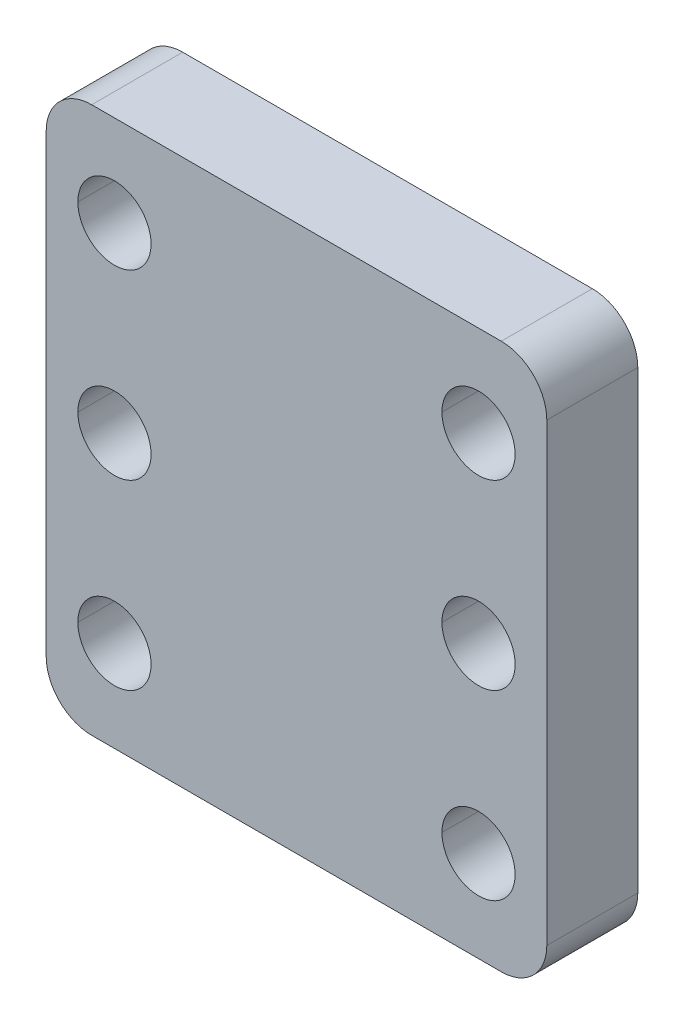
ISO-10303-21;
HEADER;
FILE_DESCRIPTION(('STEP AP214'),'2;1');
FILE_NAME('part.step','',(''),(''),'','','');
FILE_SCHEMA(('AUTOMOTIVE_DESIGN { 1 0 10303 214 1 1 1 1 }'));
ENDSEC;
DATA;
#1=APPLICATION_CONTEXT('core data for automotive mechanical design processes');
#2=APPLICATION_PROTOCOL_DEFINITION('international standard','automotive_design',2000,#1);
#3=PRODUCT_CONTEXT('',#1,'mechanical');
#4=PRODUCT('Part','Part','',(#3));
#5=PRODUCT_RELATED_PRODUCT_CATEGORY('part','',(#4));
#6=PRODUCT_DEFINITION_FORMATION('','',#4);
#7=PRODUCT_DEFINITION_CONTEXT('part definition',#1,'design');
#8=PRODUCT_DEFINITION('design','',#6,#7);
#9=PRODUCT_DEFINITION_SHAPE('','',#8);
#10=(LENGTH_UNIT() NAMED_UNIT(*) SI_UNIT(.MILLI.,.METRE.));
#11=(NAMED_UNIT(*) PLANE_ANGLE_UNIT() SI_UNIT($,.RADIAN.));
#12=(NAMED_UNIT(*) SI_UNIT($,.STERADIAN.) SOLID_ANGLE_UNIT());
#13=UNCERTAINTY_MEASURE_WITH_UNIT(LENGTH_MEASURE(1.E-05),#10,'distance_accuracy_value','');
#14=(GEOMETRIC_REPRESENTATION_CONTEXT(3) GLOBAL_UNCERTAINTY_ASSIGNED_CONTEXT((#13)) GLOBAL_UNIT_ASSIGNED_CONTEXT((#10,
#11,#12)) REPRESENTATION_CONTEXT('',''));
#15=CARTESIAN_POINT('',(0.,0.,0.));
#16=DIRECTION('',(0.,0.,1.));
#17=DIRECTION('',(1.,0.,0.));
#18=AXIS2_PLACEMENT_3D('',#15,#16,#17);
#19=CARTESIAN_POINT('',(-12.7,12.7,3.175));
#20=DIRECTION('',(0.,0.,1.));
#21=DIRECTION('',(1.,0.,0.));
#22=AXIS2_PLACEMENT_3D('',#19,#20,#21);
#23=CYLINDRICAL_SURFACE('',#22,2.5527);
#24=DIRECTION('',(0.,0.,1.));
#25=VECTOR('',#24,1.);
#26=CARTESIAN_POINT('',(-15.2527,12.7,3.175));
#27=LINE('',#26,#25);
#28=CARTESIAN_POINT('',(-15.2527,12.7,-3.175));
#29=VERTEX_POINT('',#28);
#30=CARTESIAN_POINT('',(-15.2527,12.7,3.175));
#31=VERTEX_POINT('',#30);
#32=EDGE_CURVE('E252',#29,#31,#27,.T.);
#33=ORIENTED_EDGE('',*,*,#32,.F.);
#34=CARTESIAN_POINT('',(-12.7,12.7,-3.175));
#35=DIRECTION('',(0.,0.,1.));
#36=DIRECTION('',(1.,0.,0.));
#37=AXIS2_PLACEMENT_3D('',#34,#35,#36);
#38=CIRCLE('',#37,2.5527);
#39=CARTESIAN_POINT('',(-10.1473,12.7,-3.175));
#40=VERTEX_POINT('',#39);
#41=EDGE_CURVE('E203',#40,#29,#38,.T.);
#42=ORIENTED_EDGE('',*,*,#41,.F.);
#43=DIRECTION('',(0.,0.,1.));
#44=VECTOR('',#43,1.);
#45=CARTESIAN_POINT('',(-10.1473,12.7,3.175));
#46=LINE('',#45,#44);
#47=CARTESIAN_POINT('',(-10.1473,12.7,3.175));
#48=VERTEX_POINT('',#47);
#49=EDGE_CURVE('E216',#40,#48,#46,.T.);
#50=ORIENTED_EDGE('',*,*,#49,.T.);
#51=CARTESIAN_POINT('',(-12.7,12.7,3.175));
#52=DIRECTION('',(0.,0.,1.));
#53=DIRECTION('',(1.,0.,0.));
#54=AXIS2_PLACEMENT_3D('',#51,#52,#53);
#55=CIRCLE('',#54,2.5527);
#56=EDGE_CURVE('E231',#48,#31,#55,.T.);
#57=ORIENTED_EDGE('',*,*,#56,.T.);
#58=EDGE_LOOP('',(#33,#42,#50,#57));
#59=FACE_BOUND('',#58,.T.);
#60=ADVANCED_FACE('F16',(#59),#23,.F.);
#61=CARTESIAN_POINT('',(-12.7,-12.7,3.175));
#62=DIRECTION('',(0.,0.,1.));
#63=DIRECTION('',(1.,0.,0.));
#64=AXIS2_PLACEMENT_3D('',#61,#62,#63);
#65=CYLINDRICAL_SURFACE('',#64,2.5527);
#66=DIRECTION('',(0.,0.,1.));
#67=VECTOR('',#66,1.);
#68=CARTESIAN_POINT('',(-15.2527,-12.7,3.175));
#69=LINE('',#68,#67);
#70=CARTESIAN_POINT('',(-15.2527,-12.7,-3.175));
#71=VERTEX_POINT('',#70);
#72=CARTESIAN_POINT('',(-15.2527,-12.7,3.175));
#73=VERTEX_POINT('',#72);
#74=EDGE_CURVE('E197',#71,#73,#69,.T.);
#75=ORIENTED_EDGE('',*,*,#74,.F.);
#76=CARTESIAN_POINT('',(-12.7,-12.7,-3.175));
#77=DIRECTION('',(0.,0.,1.));
#78=DIRECTION('',(1.,0.,0.));
#79=AXIS2_PLACEMENT_3D('',#76,#77,#78);
#80=CIRCLE('',#79,2.5527);
#81=CARTESIAN_POINT('',(-10.1473,-12.7,-3.175));
#82=VERTEX_POINT('',#81);
#83=EDGE_CURVE('E191',#82,#71,#80,.T.);
#84=ORIENTED_EDGE('',*,*,#83,.F.);
#85=DIRECTION('',(0.,0.,1.));
#86=VECTOR('',#85,1.);
#87=CARTESIAN_POINT('',(-10.1473,-12.7,3.175));
#88=LINE('',#87,#86);
#89=CARTESIAN_POINT('',(-10.1473,-12.7,3.175));
#90=VERTEX_POINT('',#89);
#91=EDGE_CURVE('E194',#82,#90,#88,.T.);
#92=ORIENTED_EDGE('',*,*,#91,.T.);
#93=CARTESIAN_POINT('',(-12.7,-12.7,3.175));
#94=DIRECTION('',(0.,0.,1.));
#95=DIRECTION('',(1.,0.,0.));
#96=AXIS2_PLACEMENT_3D('',#93,#94,#95);
#97=CIRCLE('',#96,2.5527);
#98=EDGE_CURVE('E304',#90,#73,#97,.T.);
#99=ORIENTED_EDGE('',*,*,#98,.T.);
#100=EDGE_LOOP('',(#75,#84,#92,#99));
#101=FACE_BOUND('',#100,.T.);
#102=ADVANCED_FACE('F193',(#101),#65,.F.);
#103=CARTESIAN_POINT('',(-12.7,0.,3.175));
#104=DIRECTION('',(0.,0.,1.));
#105=DIRECTION('',(1.,0.,0.));
#106=AXIS2_PLACEMENT_3D('',#103,#104,#105);
#107=CYLINDRICAL_SURFACE('',#106,2.5527);
#108=DIRECTION('',(0.,0.,1.));
#109=VECTOR('',#108,1.);
#110=CARTESIAN_POINT('',(-15.2527,0.,3.175));
#111=LINE('',#110,#109);
#112=CARTESIAN_POINT('',(-15.2527,0.,-3.175));
#113=VERTEX_POINT('',#112);
#114=CARTESIAN_POINT('',(-15.2527,0.,3.175));
#115=VERTEX_POINT('',#114);
#116=EDGE_CURVE('E263',#113,#115,#111,.T.);
#117=ORIENTED_EDGE('',*,*,#116,.F.);
#118=CARTESIAN_POINT('',(-12.7,0.,-3.175));
#119=DIRECTION('',(0.,0.,1.));
#120=DIRECTION('',(1.,0.,0.));
#121=AXIS2_PLACEMENT_3D('',#118,#119,#120);
#122=CIRCLE('',#121,2.5527);
#123=CARTESIAN_POINT('',(-10.1473,0.,-3.175));
#124=VERTEX_POINT('',#123);
#125=EDGE_CURVE('E202',#124,#113,#122,.T.);
#126=ORIENTED_EDGE('',*,*,#125,.F.);
#127=DIRECTION('',(0.,0.,1.));
#128=VECTOR('',#127,1.);
#129=CARTESIAN_POINT('',(-10.1473,0.,3.175));
#130=LINE('',#129,#128);
#131=CARTESIAN_POINT('',(-10.1473,0.,3.175));
#132=VERTEX_POINT('',#131);
#133=EDGE_CURVE('E262',#124,#132,#130,.T.);
#134=ORIENTED_EDGE('',*,*,#133,.T.);
#135=CARTESIAN_POINT('',(-12.7,0.,3.175));
#136=DIRECTION('',(0.,0.,1.));
#137=DIRECTION('',(1.,0.,0.));
#138=AXIS2_PLACEMENT_3D('',#135,#136,#137);
#139=CIRCLE('',#138,2.5527);
#140=EDGE_CURVE('E83',#132,#115,#139,.T.);
#141=ORIENTED_EDGE('',*,*,#140,.T.);
#142=EDGE_LOOP('',(#117,#126,#134,#141));
#143=FACE_BOUND('',#142,.T.);
#144=ADVANCED_FACE('F639',(#143),#107,.F.);
#145=CARTESIAN_POINT('',(12.7,0.,3.175));
#146=DIRECTION('',(0.,0.,1.));
#147=DIRECTION('',(1.,0.,0.));
#148=AXIS2_PLACEMENT_3D('',#145,#146,#147);
#149=CYLINDRICAL_SURFACE('',#148,2.5527);
#150=DIRECTION('',(0.,0.,1.));
#151=VECTOR('',#150,1.);
#152=CARTESIAN_POINT('',(10.1473,0.,3.175));
#153=LINE('',#152,#151);
#154=CARTESIAN_POINT('',(10.1473,0.,-3.175));
#155=VERTEX_POINT('',#154);
#156=CARTESIAN_POINT('',(10.1473,0.,3.175));
#157=VERTEX_POINT('',#156);
#158=EDGE_CURVE('E303',#155,#157,#153,.T.);
#159=ORIENTED_EDGE('',*,*,#158,.F.);
#160=CARTESIAN_POINT('',(12.7,0.,-3.175));
#161=DIRECTION('',(0.,0.,1.));
#162=DIRECTION('',(1.,0.,0.));
#163=AXIS2_PLACEMENT_3D('',#160,#161,#162);
#164=CIRCLE('',#163,2.5527);
#165=CARTESIAN_POINT('',(15.2527,0.,-3.175));
#166=VERTEX_POINT('',#165);
#167=EDGE_CURVE('E93',#166,#155,#164,.T.);
#168=ORIENTED_EDGE('',*,*,#167,.F.);
#169=DIRECTION('',(0.,0.,1.));
#170=VECTOR('',#169,1.);
#171=CARTESIAN_POINT('',(15.2527,0.,3.175));
#172=LINE('',#171,#170);
#173=CARTESIAN_POINT('',(15.2527,0.,3.175));
#174=VERTEX_POINT('',#173);
#175=EDGE_CURVE('E338',#166,#174,#172,.T.);
#176=ORIENTED_EDGE('',*,*,#175,.T.);
#177=CARTESIAN_POINT('',(12.7,0.,3.175));
#178=DIRECTION('',(0.,0.,1.));
#179=DIRECTION('',(1.,0.,0.));
#180=AXIS2_PLACEMENT_3D('',#177,#178,#179);
#181=CIRCLE('',#180,2.5527);
#182=EDGE_CURVE('E238',#174,#157,#181,.T.);
#183=ORIENTED_EDGE('',*,*,#182,.T.);
#184=EDGE_LOOP('',(#159,#168,#176,#183));
#185=FACE_BOUND('',#184,.T.);
#186=ADVANCED_FACE('F18',(#185),#149,.F.);
#187=CARTESIAN_POINT('',(12.7,12.7,3.175));
#188=DIRECTION('',(0.,0.,1.));
#189=DIRECTION('',(1.,0.,0.));
#190=AXIS2_PLACEMENT_3D('',#187,#188,#189);
#191=CYLINDRICAL_SURFACE('',#190,2.5527);
#192=DIRECTION('',(0.,0.,1.));
#193=VECTOR('',#192,1.);
#194=CARTESIAN_POINT('',(10.1473,12.7,3.175));
#195=LINE('',#194,#193);
#196=CARTESIAN_POINT('',(10.1473,12.7,-3.175));
#197=VERTEX_POINT('',#196);
#198=CARTESIAN_POINT('',(10.1473,12.7,3.175));
#199=VERTEX_POINT('',#198);
#200=EDGE_CURVE('E337',#197,#199,#195,.T.);
#201=ORIENTED_EDGE('',*,*,#200,.F.);
#202=CARTESIAN_POINT('',(12.7,12.7,-3.175));
#203=DIRECTION('',(0.,0.,1.));
#204=DIRECTION('',(1.,0.,0.));
#205=AXIS2_PLACEMENT_3D('',#202,#203,#204);
#206=CIRCLE('',#205,2.5527);
#207=CARTESIAN_POINT('',(15.2527,12.7,-3.175));
#208=VERTEX_POINT('',#207);
#209=EDGE_CURVE('E27',#208,#197,#206,.T.);
#210=ORIENTED_EDGE('',*,*,#209,.F.);
#211=DIRECTION('',(0.,0.,1.));
#212=VECTOR('',#211,1.);
#213=CARTESIAN_POINT('',(15.2527,12.7,3.175));
#214=LINE('',#213,#212);
#215=CARTESIAN_POINT('',(15.2527,12.7,3.175));
#216=VERTEX_POINT('',#215);
#217=EDGE_CURVE('E299',#208,#216,#214,.T.);
#218=ORIENTED_EDGE('',*,*,#217,.T.);
#219=CARTESIAN_POINT('',(12.7,12.7,3.175));
#220=DIRECTION('',(0.,0.,1.));
#221=DIRECTION('',(1.,0.,0.));
#222=AXIS2_PLACEMENT_3D('',#219,#220,#221);
#223=CIRCLE('',#222,2.5527);
#224=EDGE_CURVE('E241',#216,#199,#223,.T.);
#225=ORIENTED_EDGE('',*,*,#224,.T.);
#226=EDGE_LOOP('',(#201,#210,#218,#225));
#227=FACE_BOUND('',#226,.T.);
#228=ADVANCED_FACE('F683',(#227),#191,.F.);
#229=CARTESIAN_POINT('',(12.7,-12.7,3.175));
#230=DIRECTION('',(0.,0.,1.));
#231=DIRECTION('',(1.,0.,0.));
#232=AXIS2_PLACEMENT_3D('',#229,#230,#231);
#233=CYLINDRICAL_SURFACE('',#232,2.5527);
#234=DIRECTION('',(0.,0.,1.));
#235=VECTOR('',#234,1.);
#236=CARTESIAN_POINT('',(10.1473,-12.7,3.175));
#237=LINE('',#236,#235);
#238=CARTESIAN_POINT('',(10.1473,-12.7,-3.175));
#239=VERTEX_POINT('',#238);
#240=CARTESIAN_POINT('',(10.1473,-12.7,3.175));
#241=VERTEX_POINT('',#240);
#242=EDGE_CURVE('E298',#239,#241,#237,.T.);
#243=ORIENTED_EDGE('',*,*,#242,.F.);
#244=CARTESIAN_POINT('',(12.7,-12.7,-3.175));
#245=DIRECTION('',(0.,0.,1.));
#246=DIRECTION('',(1.,0.,0.));
#247=AXIS2_PLACEMENT_3D('',#244,#245,#246);
#248=CIRCLE('',#247,2.5527);
#249=CARTESIAN_POINT('',(15.2527,-12.7,-3.175));
#250=VERTEX_POINT('',#249);
#251=EDGE_CURVE('E11',#250,#239,#248,.T.);
#252=ORIENTED_EDGE('',*,*,#251,.F.);
#253=DIRECTION('',(0.,0.,1.));
#254=VECTOR('',#253,1.);
#255=CARTESIAN_POINT('',(15.2527,-12.7,3.175));
#256=LINE('',#255,#254);
#257=CARTESIAN_POINT('',(15.2527,-12.7,3.175));
#258=VERTEX_POINT('',#257);
#259=EDGE_CURVE('E307',#250,#258,#256,.T.);
#260=ORIENTED_EDGE('',*,*,#259,.T.);
#261=CARTESIAN_POINT('',(12.7,-12.7,3.175));
#262=DIRECTION('',(0.,0.,1.));
#263=DIRECTION('',(1.,0.,0.));
#264=AXIS2_PLACEMENT_3D('',#261,#262,#263);
#265=CIRCLE('',#264,2.5527);
#266=EDGE_CURVE('E20',#258,#241,#265,.T.);
#267=ORIENTED_EDGE('',*,*,#266,.T.);
#268=EDGE_LOOP('',(#243,#252,#260,#267));
#269=FACE_BOUND('',#268,.T.);
#270=ADVANCED_FACE('F606',(#269),#233,.F.);
#271=CARTESIAN_POINT('',(14.2875,15.875,3.175));
#272=DIRECTION('',(0.,0.,-1.));
#273=DIRECTION('',(-1.,0.,0.));
#274=AXIS2_PLACEMENT_3D('',#271,#272,#273);
#275=CYLINDRICAL_SURFACE('',#274,3.175);
#276=CARTESIAN_POINT('',(14.2875,15.875,3.175));
#277=DIRECTION('',(0.,0.,1.));
#278=DIRECTION('',(-1.,0.,0.));
#279=AXIS2_PLACEMENT_3D('',#276,#277,#278);
#280=CIRCLE('',#279,3.175);
#281=CARTESIAN_POINT('',(17.4625,15.875,3.175));
#282=VERTEX_POINT('',#281);
#283=CARTESIAN_POINT('',(14.2875,19.05,3.175));
#284=VERTEX_POINT('',#283);
#285=EDGE_CURVE('E279',#282,#284,#280,.T.);
#286=ORIENTED_EDGE('',*,*,#285,.F.);
#287=DIRECTION('',(0.,0.,1.));
#288=VECTOR('',#287,1.);
#289=CARTESIAN_POINT('',(17.4625,15.875,3.175));
#290=LINE('',#289,#288);
#291=CARTESIAN_POINT('',(17.4625,15.875,-3.175));
#292=VERTEX_POINT('',#291);
#293=EDGE_CURVE('E288',#292,#282,#290,.T.);
#294=ORIENTED_EDGE('',*,*,#293,.F.);
#295=CARTESIAN_POINT('',(14.2875,15.875,-3.175));
#296=DIRECTION('',(0.,0.,-1.));
#297=DIRECTION('',(-1.,0.,0.));
#298=AXIS2_PLACEMENT_3D('',#295,#296,#297);
#299=CIRCLE('',#298,3.175);
#300=CARTESIAN_POINT('',(14.2875,19.05,-3.175));
#301=VERTEX_POINT('',#300);
#302=EDGE_CURVE('E233',#301,#292,#299,.T.);
#303=ORIENTED_EDGE('',*,*,#302,.F.);
#304=DIRECTION('',(0.,0.,-1.));
#305=VECTOR('',#304,1.);
#306=CARTESIAN_POINT('',(14.2875,19.05,3.175));
#307=LINE('',#306,#305);
#308=EDGE_CURVE('E271',#284,#301,#307,.T.);
#309=ORIENTED_EDGE('',*,*,#308,.F.);
#310=EDGE_LOOP('',(#286,#294,#303,#309));
#311=FACE_BOUND('',#310,.T.);
#312=ADVANCED_FACE('F416',(#311),#275,.T.);
#313=CARTESIAN_POINT('',(-14.2875,15.875,3.175));
#314=DIRECTION('',(0.,0.,-1.));
#315=DIRECTION('',(-1.,0.,0.));
#316=AXIS2_PLACEMENT_3D('',#313,#314,#315);
#317=CYLINDRICAL_SURFACE('',#316,3.175);
#318=CARTESIAN_POINT('',(-14.2875,15.875,3.175));
#319=DIRECTION('',(0.,0.,1.));
#320=DIRECTION('',(-1.,0.,0.));
#321=AXIS2_PLACEMENT_3D('',#318,#319,#320);
#322=CIRCLE('',#321,3.175);
#323=CARTESIAN_POINT('',(-14.2875,19.05,3.175));
#324=VERTEX_POINT('',#323);
#325=CARTESIAN_POINT('',(-17.4625,15.875,3.175));
#326=VERTEX_POINT('',#325);
#327=EDGE_CURVE('E232',#324,#326,#322,.T.);
#328=ORIENTED_EDGE('',*,*,#327,.F.);
#329=DIRECTION('',(0.,0.,1.));
#330=VECTOR('',#329,1.);
#331=CARTESIAN_POINT('',(-14.2875,19.05,3.175));
#332=LINE('',#331,#330);
#333=CARTESIAN_POINT('',(-14.2875,19.05,-3.175));
#334=VERTEX_POINT('',#333);
#335=EDGE_CURVE('E272',#334,#324,#332,.T.);
#336=ORIENTED_EDGE('',*,*,#335,.F.);
#337=CARTESIAN_POINT('',(-14.2875,15.875,-3.175));
#338=DIRECTION('',(0.,0.,-1.));
#339=DIRECTION('',(-1.,0.,0.));
#340=AXIS2_PLACEMENT_3D('',#337,#338,#339);
#341=CIRCLE('',#340,3.175);
#342=CARTESIAN_POINT('',(-17.4625,15.875,-3.175));
#343=VERTEX_POINT('',#342);
#344=EDGE_CURVE('E237',#343,#334,#341,.T.);
#345=ORIENTED_EDGE('',*,*,#344,.F.);
#346=DIRECTION('',(0.,0.,-1.));
#347=VECTOR('',#346,1.);
#348=CARTESIAN_POINT('',(-17.4625,15.875,3.175));
#349=LINE('',#348,#347);
#350=EDGE_CURVE('E242',#326,#343,#349,.T.);
#351=ORIENTED_EDGE('',*,*,#350,.F.);
#352=EDGE_LOOP('',(#328,#336,#345,#351));
#353=FACE_BOUND('',#352,.T.);
#354=ADVANCED_FACE('F408',(#353),#317,.T.);
#355=CARTESIAN_POINT('',(-14.2875,-15.875,3.175));
#356=DIRECTION('',(0.,0.,-1.));
#357=DIRECTION('',(-1.,0.,0.));
#358=AXIS2_PLACEMENT_3D('',#355,#356,#357);
#359=CYLINDRICAL_SURFACE('',#358,3.175);
#360=CARTESIAN_POINT('',(-14.2875,-15.875,3.175));
#361=DIRECTION('',(0.,0.,1.));
#362=DIRECTION('',(-1.,0.,0.));
#363=AXIS2_PLACEMENT_3D('',#360,#361,#362);
#364=CIRCLE('',#363,3.175);
#365=CARTESIAN_POINT('',(-17.4625,-15.875,3.175));
#366=VERTEX_POINT('',#365);
#367=CARTESIAN_POINT('',(-14.2875,-19.05,3.175));
#368=VERTEX_POINT('',#367);
#369=EDGE_CURVE('E42',#366,#368,#364,.T.);
#370=ORIENTED_EDGE('',*,*,#369,.F.);
#371=DIRECTION('',(0.,0.,1.));
#372=VECTOR('',#371,1.);
#373=CARTESIAN_POINT('',(-17.4625,-15.875,3.175));
#374=LINE('',#373,#372);
#375=CARTESIAN_POINT('',(-17.4625,-15.875,-3.175));
#376=VERTEX_POINT('',#375);
#377=EDGE_CURVE('E287',#376,#366,#374,.T.);
#378=ORIENTED_EDGE('',*,*,#377,.F.);
#379=CARTESIAN_POINT('',(-14.2875,-15.875,-3.175));
#380=DIRECTION('',(0.,0.,-1.));
#381=DIRECTION('',(-1.,0.,0.));
#382=AXIS2_PLACEMENT_3D('',#379,#380,#381);
#383=CIRCLE('',#382,3.175);
#384=CARTESIAN_POINT('',(-14.2875,-19.05,-3.175));
#385=VERTEX_POINT('',#384);
#386=EDGE_CURVE('E318',#385,#376,#383,.T.);
#387=ORIENTED_EDGE('',*,*,#386,.F.);
#388=DIRECTION('',(0.,0.,-1.));
#389=VECTOR('',#388,1.);
#390=CARTESIAN_POINT('',(-14.2875,-19.05,3.175));
#391=LINE('',#390,#389);
#392=EDGE_CURVE('E256',#368,#385,#391,.T.);
#393=ORIENTED_EDGE('',*,*,#392,.F.);
#394=EDGE_LOOP('',(#370,#378,#387,#393));
#395=FACE_BOUND('',#394,.T.);
#396=ADVANCED_FACE('F588',(#395),#359,.T.);
#397=CARTESIAN_POINT('',(14.2875,-15.875,3.175));
#398=DIRECTION('',(0.,0.,-1.));
#399=DIRECTION('',(-1.,0.,0.));
#400=AXIS2_PLACEMENT_3D('',#397,#398,#399);
#401=CYLINDRICAL_SURFACE('',#400,3.175);
#402=CARTESIAN_POINT('',(14.2875,-15.875,3.175));
#403=DIRECTION('',(0.,0.,1.));
#404=DIRECTION('',(-1.,0.,0.));
#405=AXIS2_PLACEMENT_3D('',#402,#403,#404);
#406=CIRCLE('',#405,3.175);
#407=CARTESIAN_POINT('',(14.2875,-19.05,3.175));
#408=VERTEX_POINT('',#407);
#409=CARTESIAN_POINT('',(17.4625,-15.875,3.175));
#410=VERTEX_POINT('',#409);
#411=EDGE_CURVE('E276',#408,#410,#406,.T.);
#412=ORIENTED_EDGE('',*,*,#411,.F.);
#413=DIRECTION('',(0.,0.,1.));
#414=VECTOR('',#413,1.);
#415=CARTESIAN_POINT('',(14.2875,-19.05,3.175));
#416=LINE('',#415,#414);
#417=CARTESIAN_POINT('',(14.2875,-19.05,-3.175));
#418=VERTEX_POINT('',#417);
#419=EDGE_CURVE('E257',#418,#408,#416,.T.);
#420=ORIENTED_EDGE('',*,*,#419,.F.);
#421=CARTESIAN_POINT('',(14.2875,-15.875,-3.175));
#422=DIRECTION('',(0.,0.,-1.));
#423=DIRECTION('',(-1.,0.,0.));
#424=AXIS2_PLACEMENT_3D('',#421,#422,#423);
#425=CIRCLE('',#424,3.175);
#426=CARTESIAN_POINT('',(17.4625,-15.875,-3.175));
#427=VERTEX_POINT('',#426);
#428=EDGE_CURVE('E575',#427,#418,#425,.T.);
#429=ORIENTED_EDGE('',*,*,#428,.F.);
#430=DIRECTION('',(0.,0.,-1.));
#431=VECTOR('',#430,1.);
#432=CARTESIAN_POINT('',(17.4625,-15.875,3.175));
#433=LINE('',#432,#431);
#434=EDGE_CURVE('E345',#410,#427,#433,.T.);
#435=ORIENTED_EDGE('',*,*,#434,.F.);
#436=EDGE_LOOP('',(#412,#420,#429,#435));
#437=FACE_BOUND('',#436,.T.);
#438=ADVANCED_FACE('F582',(#437),#401,.T.);
#439=CARTESIAN_POINT('',(0.,0.,-3.175));
#440=DIRECTION('',(0.,0.,-1.));
#441=DIRECTION('',(0.,-1.,0.));
#442=AXIS2_PLACEMENT_3D('',#439,#440,#441);
#443=PLANE('',#442);
#444=ORIENTED_EDGE('',*,*,#251,.T.);
#445=CARTESIAN_POINT('',(12.7,-12.7,-3.175));
#446=DIRECTION('',(0.,0.,1.));
#447=DIRECTION('',(1.,0.,0.));
#448=AXIS2_PLACEMENT_3D('',#445,#446,#447);
#449=CIRCLE('',#448,2.5527);
#450=EDGE_CURVE('E294',#239,#250,#449,.T.);
#451=ORIENTED_EDGE('',*,*,#450,.T.);
#452=EDGE_LOOP('',(#444,#451));
#453=FACE_BOUND('',#452,.T.);
#454=ORIENTED_EDGE('',*,*,#209,.T.);
#455=CARTESIAN_POINT('',(12.7,12.7,-3.175));
#456=DIRECTION('',(0.,0.,1.));
#457=DIRECTION('',(1.,0.,0.));
#458=AXIS2_PLACEMENT_3D('',#455,#456,#457);
#459=CIRCLE('',#458,2.5527);
#460=EDGE_CURVE('E333',#197,#208,#459,.T.);
#461=ORIENTED_EDGE('',*,*,#460,.T.);
#462=EDGE_LOOP('',(#454,#461));
#463=FACE_BOUND('',#462,.T.);
#464=ORIENTED_EDGE('',*,*,#167,.T.);
#465=CARTESIAN_POINT('',(12.7,0.,-3.175));
#466=DIRECTION('',(0.,0.,1.));
#467=DIRECTION('',(1.,0.,0.));
#468=AXIS2_PLACEMENT_3D('',#465,#466,#467);
#469=CIRCLE('',#468,2.5527);
#470=EDGE_CURVE('E300',#155,#166,#469,.T.);
#471=ORIENTED_EDGE('',*,*,#470,.T.);
#472=EDGE_LOOP('',(#464,#471));
#473=FACE_BOUND('',#472,.T.);
#474=ORIENTED_EDGE('',*,*,#125,.T.);
#475=CARTESIAN_POINT('',(-12.7,0.,-3.175));
#476=DIRECTION('',(0.,0.,1.));
#477=DIRECTION('',(1.,0.,0.));
#478=AXIS2_PLACEMENT_3D('',#475,#476,#477);
#479=CIRCLE('',#478,2.5527);
#480=EDGE_CURVE('E211',#113,#124,#479,.T.);
#481=ORIENTED_EDGE('',*,*,#480,.T.);
#482=EDGE_LOOP('',(#474,#481));
#483=FACE_BOUND('',#482,.T.);
#484=ORIENTED_EDGE('',*,*,#83,.T.);
#485=CARTESIAN_POINT('',(-12.7,-12.7,-3.175));
#486=DIRECTION('',(0.,0.,1.));
#487=DIRECTION('',(1.,0.,0.));
#488=AXIS2_PLACEMENT_3D('',#485,#486,#487);
#489=CIRCLE('',#488,2.5527);
#490=EDGE_CURVE('E207',#71,#82,#489,.T.);
#491=ORIENTED_EDGE('',*,*,#490,.T.);
#492=EDGE_LOOP('',(#484,#491));
#493=FACE_BOUND('',#492,.T.);
#494=ORIENTED_EDGE('',*,*,#41,.T.);
#495=CARTESIAN_POINT('',(-12.7,12.7,-3.175));
#496=DIRECTION('',(0.,0.,1.));
#497=DIRECTION('',(1.,0.,0.));
#498=AXIS2_PLACEMENT_3D('',#495,#496,#497);
#499=CIRCLE('',#498,2.5527);
#500=EDGE_CURVE('E248',#29,#40,#499,.T.);
#501=ORIENTED_EDGE('',*,*,#500,.T.);
#502=EDGE_LOOP('',(#494,#501));
#503=FACE_BOUND('',#502,.T.);
#504=DIRECTION('',(0.,1.,0.));
#505=VECTOR('',#504,1.);
#506=CARTESIAN_POINT('',(17.4625,-19.05,-3.175));
#507=LINE('',#506,#505);
#508=EDGE_CURVE('E293',#427,#292,#507,.T.);
#509=ORIENTED_EDGE('',*,*,#508,.F.);
#510=ORIENTED_EDGE('',*,*,#428,.T.);
#511=DIRECTION('',(1.,0.,0.));
#512=VECTOR('',#511,1.);
#513=CARTESIAN_POINT('',(-17.4625,-19.05,-3.175));
#514=LINE('',#513,#512);
#515=EDGE_CURVE('E246',#385,#418,#514,.T.);
#516=ORIENTED_EDGE('',*,*,#515,.F.);
#517=ORIENTED_EDGE('',*,*,#386,.T.);
#518=DIRECTION('',(0.,-1.,0.));
#519=VECTOR('',#518,1.);
#520=CARTESIAN_POINT('',(-17.4625,-19.05,-3.175));
#521=LINE('',#520,#519);
#522=EDGE_CURVE('E326',#343,#376,#521,.T.);
#523=ORIENTED_EDGE('',*,*,#522,.F.);
#524=ORIENTED_EDGE('',*,*,#344,.T.);
#525=DIRECTION('',(-1.,0.,0.));
#526=VECTOR('',#525,1.);
#527=CARTESIAN_POINT('',(-17.4625,19.05,-3.175));
#528=LINE('',#527,#526);
#529=EDGE_CURVE('E292',#301,#334,#528,.T.);
#530=ORIENTED_EDGE('',*,*,#529,.F.);
#531=ORIENTED_EDGE('',*,*,#302,.T.);
#532=EDGE_LOOP('',(#509,#510,#516,#517,#523,#524,#530,#531));
#533=FACE_BOUND('',#532,.T.);
#534=ADVANCED_FACE('F213',(#453,#463,#473,#483,#493,#503,#533),#443,.T.);
#535=CARTESIAN_POINT('',(0.,0.,3.175));
#536=DIRECTION('',(0.,0.,-1.));
#537=DIRECTION('',(0.,-1.,0.));
#538=AXIS2_PLACEMENT_3D('',#535,#536,#537);
#539=PLANE('',#538);
#540=ORIENTED_EDGE('',*,*,#266,.F.);
#541=CARTESIAN_POINT('',(12.7,-12.7,3.175));
#542=DIRECTION('',(0.,0.,1.));
#543=DIRECTION('',(1.,0.,0.));
#544=AXIS2_PLACEMENT_3D('',#541,#542,#543);
#545=CIRCLE('',#544,2.5527);
#546=EDGE_CURVE('E312',#241,#258,#545,.T.);
#547=ORIENTED_EDGE('',*,*,#546,.F.);
#548=EDGE_LOOP('',(#540,#547));
#549=FACE_BOUND('',#548,.T.);
#550=ORIENTED_EDGE('',*,*,#224,.F.);
#551=CARTESIAN_POINT('',(12.7,12.7,3.175));
#552=DIRECTION('',(0.,0.,1.));
#553=DIRECTION('',(1.,0.,0.));
#554=AXIS2_PLACEMENT_3D('',#551,#552,#553);
#555=CIRCLE('',#554,2.5527);
#556=EDGE_CURVE('E316',#199,#216,#555,.T.);
#557=ORIENTED_EDGE('',*,*,#556,.F.);
#558=EDGE_LOOP('',(#550,#557));
#559=FACE_BOUND('',#558,.T.);
#560=ORIENTED_EDGE('',*,*,#182,.F.);
#561=CARTESIAN_POINT('',(12.7,0.,3.175));
#562=DIRECTION('',(0.,0.,1.));
#563=DIRECTION('',(1.,0.,0.));
#564=AXIS2_PLACEMENT_3D('',#561,#562,#563);
#565=CIRCLE('',#564,2.5527);
#566=EDGE_CURVE('E331',#157,#174,#565,.T.);
#567=ORIENTED_EDGE('',*,*,#566,.F.);
#568=EDGE_LOOP('',(#560,#567));
#569=FACE_BOUND('',#568,.T.);
#570=ORIENTED_EDGE('',*,*,#140,.F.);
#571=CARTESIAN_POINT('',(-12.7,0.,3.175));
#572=DIRECTION('',(0.,0.,1.));
#573=DIRECTION('',(1.,0.,0.));
#574=AXIS2_PLACEMENT_3D('',#571,#572,#573);
#575=CIRCLE('',#574,2.5527);
#576=EDGE_CURVE('E258',#115,#132,#575,.T.);
#577=ORIENTED_EDGE('',*,*,#576,.F.);
#578=EDGE_LOOP('',(#570,#577));
#579=FACE_BOUND('',#578,.T.);
#580=ORIENTED_EDGE('',*,*,#98,.F.);
#581=CARTESIAN_POINT('',(-12.7,-12.7,3.175));
#582=DIRECTION('',(0.,0.,1.));
#583=DIRECTION('',(1.,0.,0.));
#584=AXIS2_PLACEMENT_3D('',#581,#582,#583);
#585=CIRCLE('',#584,2.5527);
#586=EDGE_CURVE('E209',#73,#90,#585,.T.);
#587=ORIENTED_EDGE('',*,*,#586,.F.);
#588=EDGE_LOOP('',(#580,#587));
#589=FACE_BOUND('',#588,.T.);
#590=ORIENTED_EDGE('',*,*,#56,.F.);
#591=CARTESIAN_POINT('',(-12.7,12.7,3.175));
#592=DIRECTION('',(0.,0.,1.));
#593=DIRECTION('',(1.,0.,0.));
#594=AXIS2_PLACEMENT_3D('',#591,#592,#593);
#595=CIRCLE('',#594,2.5527);
#596=EDGE_CURVE('E225',#31,#48,#595,.T.);
#597=ORIENTED_EDGE('',*,*,#596,.F.);
#598=EDGE_LOOP('',(#590,#597));
#599=FACE_BOUND('',#598,.T.);
#600=DIRECTION('',(1.,0.,0.));
#601=VECTOR('',#600,1.);
#602=CARTESIAN_POINT('',(-17.4625,-19.05,3.175));
#603=LINE('',#602,#601);
#604=EDGE_CURVE('E253',#368,#408,#603,.T.);
#605=ORIENTED_EDGE('',*,*,#604,.T.);
#606=ORIENTED_EDGE('',*,*,#411,.T.);
#607=DIRECTION('',(0.,1.,0.));
#608=VECTOR('',#607,1.);
#609=CARTESIAN_POINT('',(17.4625,-19.05,3.175));
#610=LINE('',#609,#608);
#611=EDGE_CURVE('E311',#410,#282,#610,.T.);
#612=ORIENTED_EDGE('',*,*,#611,.T.);
#613=ORIENTED_EDGE('',*,*,#285,.T.);
#614=DIRECTION('',(-1.,0.,0.));
#615=VECTOR('',#614,1.);
#616=CARTESIAN_POINT('',(-17.4625,19.05,3.175));
#617=LINE('',#616,#615);
#618=EDGE_CURVE('E267',#284,#324,#617,.T.);
#619=ORIENTED_EDGE('',*,*,#618,.T.);
#620=ORIENTED_EDGE('',*,*,#327,.T.);
#621=DIRECTION('',(0.,-1.,0.));
#622=VECTOR('',#621,1.);
#623=CARTESIAN_POINT('',(-17.4625,-19.05,3.175));
#624=LINE('',#623,#622);
#625=EDGE_CURVE('E247',#326,#366,#624,.T.);
#626=ORIENTED_EDGE('',*,*,#625,.T.);
#627=ORIENTED_EDGE('',*,*,#369,.T.);
#628=EDGE_LOOP('',(#605,#606,#612,#613,#619,#620,#626,#627));
#629=FACE_BOUND('',#628,.T.);
#630=ADVANCED_FACE('F411',(#549,#559,#569,#579,#589,#599,#629),#539,.F.);
#631=CARTESIAN_POINT('',(-17.4625,-19.05,3.175));
#632=DIRECTION('',(0.,1.,0.));
#633=DIRECTION('',(1.,0.,0.));
#634=AXIS2_PLACEMENT_3D('',#631,#632,#633);
#635=PLANE('',#634);
#636=ORIENTED_EDGE('',*,*,#515,.T.);
#637=ORIENTED_EDGE('',*,*,#419,.T.);
#638=ORIENTED_EDGE('',*,*,#604,.F.);
#639=ORIENTED_EDGE('',*,*,#392,.T.);
#640=EDGE_LOOP('',(#636,#637,#638,#639));
#641=FACE_BOUND('',#640,.T.);
#642=ADVANCED_FACE('F586',(#641),#635,.F.);
#643=CARTESIAN_POINT('',(-17.4625,-19.05,3.175));
#644=DIRECTION('',(1.,0.,0.));
#645=DIRECTION('',(0.,1.,0.));
#646=AXIS2_PLACEMENT_3D('',#643,#644,#645);
#647=PLANE('',#646);
#648=ORIENTED_EDGE('',*,*,#522,.T.);
#649=ORIENTED_EDGE('',*,*,#377,.T.);
#650=ORIENTED_EDGE('',*,*,#625,.F.);
#651=ORIENTED_EDGE('',*,*,#350,.T.);
#652=EDGE_LOOP('',(#648,#649,#650,#651));
#653=FACE_BOUND('',#652,.T.);
#654=ADVANCED_FACE('F423',(#653),#647,.F.);
#655=CARTESIAN_POINT('',(-17.4625,19.05,3.175));
#656=DIRECTION('',(0.,-1.,0.));
#657=DIRECTION('',(0.,0.,-1.));
#658=AXIS2_PLACEMENT_3D('',#655,#656,#657);
#659=PLANE('',#658);
#660=ORIENTED_EDGE('',*,*,#529,.T.);
#661=ORIENTED_EDGE('',*,*,#335,.T.);
#662=ORIENTED_EDGE('',*,*,#618,.F.);
#663=ORIENTED_EDGE('',*,*,#308,.T.);
#664=EDGE_LOOP('',(#660,#661,#662,#663));
#665=FACE_BOUND('',#664,.T.);
#666=ADVANCED_FACE('F405',(#665),#659,.F.);
#667=CARTESIAN_POINT('',(17.4625,-19.05,3.175));
#668=DIRECTION('',(-1.,0.,0.));
#669=DIRECTION('',(0.,0.,1.));
#670=AXIS2_PLACEMENT_3D('',#667,#668,#669);
#671=PLANE('',#670);
#672=ORIENTED_EDGE('',*,*,#611,.F.);
#673=ORIENTED_EDGE('',*,*,#434,.T.);
#674=ORIENTED_EDGE('',*,*,#508,.T.);
#675=ORIENTED_EDGE('',*,*,#293,.T.);
#676=EDGE_LOOP('',(#672,#673,#674,#675));
#677=FACE_BOUND('',#676,.T.);
#678=ADVANCED_FACE('F651',(#677),#671,.F.);
#679=CARTESIAN_POINT('',(12.7,-12.7,3.175));
#680=DIRECTION('',(0.,0.,1.));
#681=DIRECTION('',(1.,0.,0.));
#682=AXIS2_PLACEMENT_3D('',#679,#680,#681);
#683=CYLINDRICAL_SURFACE('',#682,2.5527);
#684=ORIENTED_EDGE('',*,*,#450,.F.);
#685=ORIENTED_EDGE('',*,*,#242,.T.);
#686=ORIENTED_EDGE('',*,*,#546,.T.);
#687=ORIENTED_EDGE('',*,*,#259,.F.);
#688=EDGE_LOOP('',(#684,#685,#686,#687));
#689=FACE_BOUND('',#688,.T.);
#690=ADVANCED_FACE('F602',(#689),#683,.F.);
#691=CARTESIAN_POINT('',(12.7,12.7,3.175));
#692=DIRECTION('',(0.,0.,1.));
#693=DIRECTION('',(1.,0.,0.));
#694=AXIS2_PLACEMENT_3D('',#691,#692,#693);
#695=CYLINDRICAL_SURFACE('',#694,2.5527);
#696=ORIENTED_EDGE('',*,*,#460,.F.);
#697=ORIENTED_EDGE('',*,*,#200,.T.);
#698=ORIENTED_EDGE('',*,*,#556,.T.);
#699=ORIENTED_EDGE('',*,*,#217,.F.);
#700=EDGE_LOOP('',(#696,#697,#698,#699));
#701=FACE_BOUND('',#700,.T.);
#702=ADVANCED_FACE('F645',(#701),#695,.F.);
#703=CARTESIAN_POINT('',(12.7,0.,3.175));
#704=DIRECTION('',(0.,0.,1.));
#705=DIRECTION('',(1.,0.,0.));
#706=AXIS2_PLACEMENT_3D('',#703,#704,#705);
#707=CYLINDRICAL_SURFACE('',#706,2.5527);
#708=ORIENTED_EDGE('',*,*,#470,.F.);
#709=ORIENTED_EDGE('',*,*,#158,.T.);
#710=ORIENTED_EDGE('',*,*,#566,.T.);
#711=ORIENTED_EDGE('',*,*,#175,.F.);
#712=EDGE_LOOP('',(#708,#709,#710,#711));
#713=FACE_BOUND('',#712,.T.);
#714=ADVANCED_FACE('F648',(#713),#707,.F.);
#715=CARTESIAN_POINT('',(-12.7,0.,3.175));
#716=DIRECTION('',(0.,0.,1.));
#717=DIRECTION('',(1.,0.,0.));
#718=AXIS2_PLACEMENT_3D('',#715,#716,#717);
#719=CYLINDRICAL_SURFACE('',#718,2.5527);
#720=ORIENTED_EDGE('',*,*,#480,.F.);
#721=ORIENTED_EDGE('',*,*,#116,.T.);
#722=ORIENTED_EDGE('',*,*,#576,.T.);
#723=ORIENTED_EDGE('',*,*,#133,.F.);
#724=EDGE_LOOP('',(#720,#721,#722,#723));
#725=FACE_BOUND('',#724,.T.);
#726=ADVANCED_FACE('F652',(#725),#719,.F.);
#727=CARTESIAN_POINT('',(-12.7,-12.7,3.175));
#728=DIRECTION('',(0.,0.,1.));
#729=DIRECTION('',(1.,0.,0.));
#730=AXIS2_PLACEMENT_3D('',#727,#728,#729);
#731=CYLINDRICAL_SURFACE('',#730,2.5527);
#732=ORIENTED_EDGE('',*,*,#490,.F.);
#733=ORIENTED_EDGE('',*,*,#74,.T.);
#734=ORIENTED_EDGE('',*,*,#586,.T.);
#735=ORIENTED_EDGE('',*,*,#91,.F.);
#736=EDGE_LOOP('',(#732,#733,#734,#735));
#737=FACE_BOUND('',#736,.T.);
#738=ADVANCED_FACE('F206',(#737),#731,.F.);
#739=CARTESIAN_POINT('',(-12.7,12.7,3.175));
#740=DIRECTION('',(0.,0.,1.));
#741=DIRECTION('',(1.,0.,0.));
#742=AXIS2_PLACEMENT_3D('',#739,#740,#741);
#743=CYLINDRICAL_SURFACE('',#742,2.5527);
#744=ORIENTED_EDGE('',*,*,#500,.F.);
#745=ORIENTED_EDGE('',*,*,#32,.T.);
#746=ORIENTED_EDGE('',*,*,#596,.T.);
#747=ORIENTED_EDGE('',*,*,#49,.F.);
#748=EDGE_LOOP('',(#744,#745,#746,#747));
#749=FACE_BOUND('',#748,.T.);
#750=ADVANCED_FACE('F624',(#749),#743,.F.);
#751=CLOSED_SHELL('',(#60,#102,#144,#186,#228,#270,#312,#354,#396,#438,#534,#630,#642,#654,#666,
#678,#690,#702,#714,#726,#738,#750));
#752=MANIFOLD_SOLID_BREP('B1',#751);
#753=ADVANCED_BREP_SHAPE_REPRESENTATION('',(#18,#752),#14);
#754=SHAPE_DEFINITION_REPRESENTATION(#9,#753);
ENDSEC;
END-ISO-10303-21;
